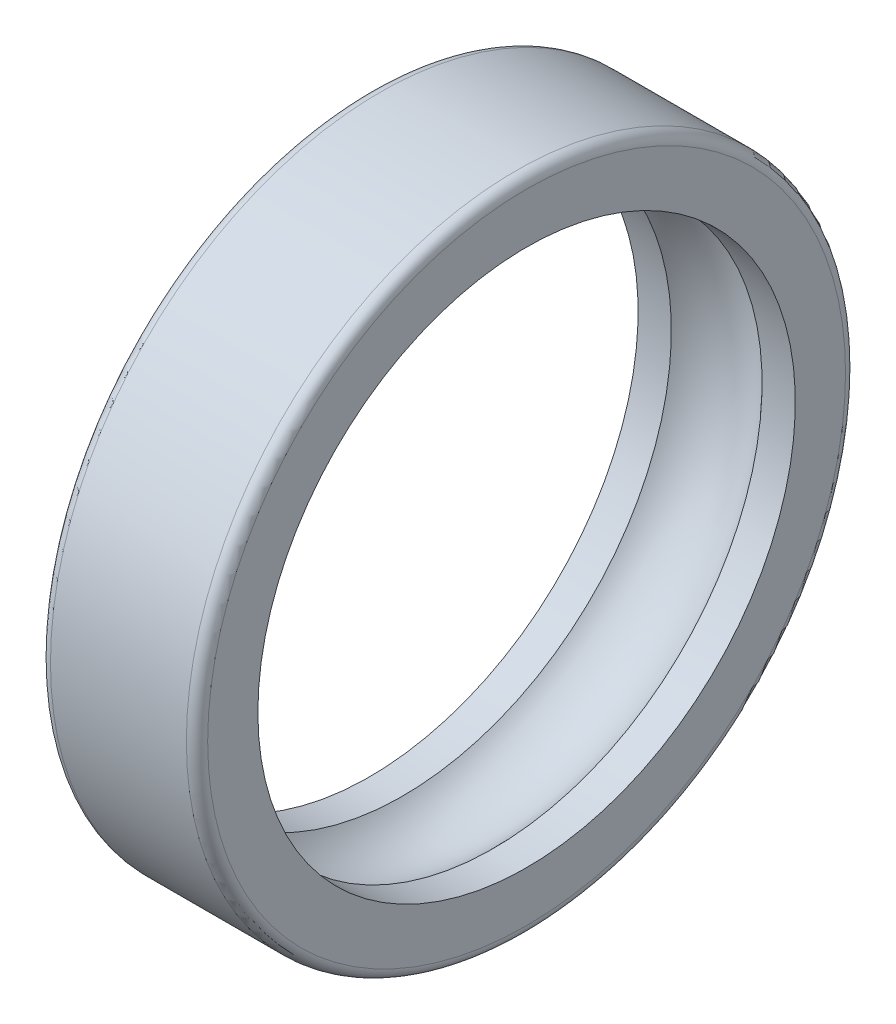
ISO-10303-21;
HEADER;
FILE_DESCRIPTION(('STEP AP214'),'2;1');
FILE_NAME('part.step','',(''),(''),'','','');
FILE_SCHEMA(('AUTOMOTIVE_DESIGN { 1 0 10303 214 1 1 1 1 }'));
ENDSEC;
DATA;
#1=APPLICATION_CONTEXT('core data for automotive mechanical design processes');
#2=APPLICATION_PROTOCOL_DEFINITION('international standard','automotive_design',2000,#1);
#3=PRODUCT_CONTEXT('',#1,'mechanical');
#4=PRODUCT('Part','Part','',(#3));
#5=PRODUCT_RELATED_PRODUCT_CATEGORY('part','',(#4));
#6=PRODUCT_DEFINITION_FORMATION('','',#4);
#7=PRODUCT_DEFINITION_CONTEXT('part definition',#1,'design');
#8=PRODUCT_DEFINITION('design','',#6,#7);
#9=PRODUCT_DEFINITION_SHAPE('','',#8);
#10=(LENGTH_UNIT() NAMED_UNIT(*) SI_UNIT(.MILLI.,.METRE.));
#11=(NAMED_UNIT(*) PLANE_ANGLE_UNIT() SI_UNIT($,.RADIAN.));
#12=(NAMED_UNIT(*) SI_UNIT($,.STERADIAN.) SOLID_ANGLE_UNIT());
#13=UNCERTAINTY_MEASURE_WITH_UNIT(LENGTH_MEASURE(1.E-05),#10,'distance_accuracy_value','');
#14=(GEOMETRIC_REPRESENTATION_CONTEXT(3) GLOBAL_UNCERTAINTY_ASSIGNED_CONTEXT((#13)) GLOBAL_UNIT_ASSIGNED_CONTEXT((#10,
#11,#12)) REPRESENTATION_CONTEXT('',''));
#15=CARTESIAN_POINT('',(0.,0.,0.));
#16=DIRECTION('',(0.,0.,1.));
#17=DIRECTION('',(1.,0.,0.));
#18=AXIS2_PLACEMENT_3D('',#15,#16,#17);
#19=CARTESIAN_POINT('',(-14.0178001277139,0.,0.));
#20=DIRECTION('',(-1.,0.,0.));
#21=DIRECTION('',(0.,0.,1.));
#22=AXIS2_PLACEMENT_3D('',#19,#20,#21);
#23=CYLINDRICAL_SURFACE('',#22,53.);
#24=CARTESIAN_POINT('',(-8.94427190999916,0.,0.));
#25=DIRECTION('',(-1.,0.,0.));
#26=DIRECTION('',(0.,0.,1.));
#27=AXIS2_PLACEMENT_3D('',#24,#25,#26);
#28=CIRCLE('',#27,53.);
#29=CARTESIAN_POINT('',(-8.94427190999916,0.,53.));
#30=VERTEX_POINT('',#29);
#31=EDGE_CURVE('E69',#30,#30,#28,.T.);
#32=ORIENTED_EDGE('',*,*,#31,.F.);
#33=EDGE_LOOP('',(#32));
#34=FACE_BOUND('',#33,.T.);
#35=CARTESIAN_POINT('',(-15.5,0.,0.));
#36=DIRECTION('',(-1.,0.,0.));
#37=DIRECTION('',(0.,0.,1.));
#38=AXIS2_PLACEMENT_3D('',#35,#36,#37);
#39=CIRCLE('',#38,53.);
#40=CARTESIAN_POINT('',(-15.5,0.,53.));
#41=VERTEX_POINT('',#40);
#42=EDGE_CURVE('E81',#41,#41,#39,.T.);
#43=ORIENTED_EDGE('',*,*,#42,.T.);
#44=EDGE_LOOP('',(#43));
#45=FACE_BOUND('',#44,.T.);
#46=ADVANCED_FACE('F45',(#34,#45),#23,.F.);
#47=CARTESIAN_POINT('',(0.,0.,0.));
#48=DIRECTION('',(-1.,0.,0.));
#49=DIRECTION('',(0.,0.,1.));
#50=AXIS2_PLACEMENT_3D('',#47,#48,#49);
#51=TOROIDAL_SURFACE('',#50,45.,12.);
#52=CARTESIAN_POINT('',(8.94427190999916,0.,0.));
#53=DIRECTION('',(-1.,0.,0.));
#54=DIRECTION('',(0.,0.,1.));
#55=AXIS2_PLACEMENT_3D('',#52,#53,#54);
#56=CIRCLE('',#55,53.);
#57=CARTESIAN_POINT('',(8.94427190999916,0.,53.));
#58=VERTEX_POINT('',#57);
#59=EDGE_CURVE('E73',#58,#58,#56,.T.);
#60=ORIENTED_EDGE('',*,*,#59,.F.);
#61=EDGE_LOOP('',(#60));
#62=FACE_BOUND('',#61,.T.);
#63=ORIENTED_EDGE('',*,*,#31,.T.);
#64=EDGE_LOOP('',(#63));
#65=FACE_BOUND('',#64,.T.);
#66=ADVANCED_FACE('F101',(#62,#65),#51,.F.);
#67=CARTESIAN_POINT('',(-14.0178001277139,0.,0.));
#68=DIRECTION('',(-1.,0.,0.));
#69=DIRECTION('',(0.,0.,1.));
#70=AXIS2_PLACEMENT_3D('',#67,#68,#69);
#71=CYLINDRICAL_SURFACE('',#70,53.);
#72=CARTESIAN_POINT('',(15.5,0.,0.));
#73=DIRECTION('',(-1.,0.,0.));
#74=DIRECTION('',(0.,0.,1.));
#75=AXIS2_PLACEMENT_3D('',#72,#73,#74);
#76=CIRCLE('',#75,53.);
#77=CARTESIAN_POINT('',(15.5,0.,53.));
#78=VERTEX_POINT('',#77);
#79=EDGE_CURVE('E77',#78,#78,#76,.T.);
#80=ORIENTED_EDGE('',*,*,#79,.F.);
#81=EDGE_LOOP('',(#80));
#82=FACE_BOUND('',#81,.T.);
#83=ORIENTED_EDGE('',*,*,#59,.T.);
#84=EDGE_LOOP('',(#83));
#85=FACE_BOUND('',#84,.T.);
#86=ADVANCED_FACE('F107',(#82,#85),#71,.F.);
#87=CARTESIAN_POINT('',(15.5,65.,0.));
#88=DIRECTION('',(-1.,0.,0.));
#89=DIRECTION('',(0.,0.,1.));
#90=AXIS2_PLACEMENT_3D('',#87,#88,#89);
#91=PLANE('',#90);
#92=CARTESIAN_POINT('',(15.5,0.,0.));
#93=DIRECTION('',(-1.,0.,0.));
#94=DIRECTION('',(0.,0.,1.));
#95=AXIS2_PLACEMENT_3D('',#92,#93,#94);
#96=CIRCLE('',#95,62.9);
#97=CARTESIAN_POINT('',(15.5,0.,62.9));
#98=VERTEX_POINT('',#97);
#99=EDGE_CURVE('E53',#98,#98,#96,.F.);
#100=ORIENTED_EDGE('',*,*,#99,.T.);
#101=EDGE_LOOP('',(#100));
#102=FACE_BOUND('',#101,.T.);
#103=ORIENTED_EDGE('',*,*,#79,.T.);
#104=EDGE_LOOP('',(#103));
#105=FACE_BOUND('',#104,.T.);
#106=ADVANCED_FACE('F97',(#102,#105),#91,.F.);
#107=CARTESIAN_POINT('',(-14.0178001277139,0.,0.));
#108=DIRECTION('',(-1.,0.,0.));
#109=DIRECTION('',(0.,0.,1.));
#110=AXIS2_PLACEMENT_3D('',#107,#108,#109);
#111=CYLINDRICAL_SURFACE('',#110,65.);
#112=CARTESIAN_POINT('',(13.4,0.,0.));
#113=DIRECTION('',(-1.,0.,0.));
#114=DIRECTION('',(0.,0.,1.));
#115=AXIS2_PLACEMENT_3D('',#112,#113,#114);
#116=CIRCLE('',#115,65.);
#117=CARTESIAN_POINT('',(13.4,0.,65.));
#118=VERTEX_POINT('',#117);
#119=EDGE_CURVE('E58',#118,#118,#116,.T.);
#120=ORIENTED_EDGE('',*,*,#119,.T.);
#121=EDGE_LOOP('',(#120));
#122=FACE_BOUND('',#121,.T.);
#123=CARTESIAN_POINT('',(-13.4,0.,0.));
#124=DIRECTION('',(1.,0.,0.));
#125=DIRECTION('',(0.,0.,-1.));
#126=AXIS2_PLACEMENT_3D('',#123,#124,#125);
#127=CIRCLE('',#126,65.);
#128=CARTESIAN_POINT('',(-13.4,0.,-65.));
#129=VERTEX_POINT('',#128);
#130=EDGE_CURVE('E63',#129,#129,#127,.T.);
#131=ORIENTED_EDGE('',*,*,#130,.T.);
#132=EDGE_LOOP('',(#131));
#133=FACE_BOUND('',#132,.T.);
#134=ADVANCED_FACE('F90',(#122,#133),#111,.T.);
#135=CARTESIAN_POINT('',(-15.5,65.,0.));
#136=DIRECTION('',(1.,0.,0.));
#137=DIRECTION('',(0.,0.,-1.));
#138=AXIS2_PLACEMENT_3D('',#135,#136,#137);
#139=PLANE('',#138);
#140=CARTESIAN_POINT('',(-15.5,0.,0.));
#141=DIRECTION('',(1.,0.,0.));
#142=DIRECTION('',(0.,0.,-1.));
#143=AXIS2_PLACEMENT_3D('',#140,#141,#142);
#144=CIRCLE('',#143,62.9);
#145=CARTESIAN_POINT('',(-15.5,0.,-62.9));
#146=VERTEX_POINT('',#145);
#147=EDGE_CURVE('E10',#146,#146,#144,.F.);
#148=ORIENTED_EDGE('',*,*,#147,.T.);
#149=EDGE_LOOP('',(#148));
#150=FACE_BOUND('',#149,.T.);
#151=ORIENTED_EDGE('',*,*,#42,.F.);
#152=EDGE_LOOP('',(#151));
#153=FACE_BOUND('',#152,.T.);
#154=ADVANCED_FACE('F87',(#150,#153),#139,.F.);
#155=CARTESIAN_POINT('',(13.4,0.,0.));
#156=DIRECTION('',(-1.,0.,0.));
#157=DIRECTION('',(0.,0.,1.));
#158=AXIS2_PLACEMENT_3D('',#155,#156,#157);
#159=TOROIDAL_SURFACE('',#158,62.9,2.1);
#160=ORIENTED_EDGE('',*,*,#99,.F.);
#161=EDGE_LOOP('',(#160));
#162=FACE_BOUND('',#161,.T.);
#163=ORIENTED_EDGE('',*,*,#119,.F.);
#164=EDGE_LOOP('',(#163));
#165=FACE_BOUND('',#164,.T.);
#166=ADVANCED_FACE('F89',(#162,#165),#159,.T.);
#167=CARTESIAN_POINT('',(-13.4,0.,0.));
#168=DIRECTION('',(1.,0.,0.));
#169=DIRECTION('',(0.,0.,-1.));
#170=AXIS2_PLACEMENT_3D('',#167,#168,#169);
#171=TOROIDAL_SURFACE('',#170,62.9,2.1);
#172=ORIENTED_EDGE('',*,*,#130,.F.);
#173=EDGE_LOOP('',(#172));
#174=FACE_BOUND('',#173,.T.);
#175=ORIENTED_EDGE('',*,*,#147,.F.);
#176=EDGE_LOOP('',(#175));
#177=FACE_BOUND('',#176,.T.);
#178=ADVANCED_FACE('F47',(#174,#177),#171,.T.);
#179=CLOSED_SHELL('',(#46,#66,#86,#106,#134,#154,#166,#178));
#180=MANIFOLD_SOLID_BREP('B2',#179);
#181=ADVANCED_BREP_SHAPE_REPRESENTATION('',(#18,#180),#14);
#182=SHAPE_DEFINITION_REPRESENTATION(#9,#181);
ENDSEC;
END-ISO-10303-21;
